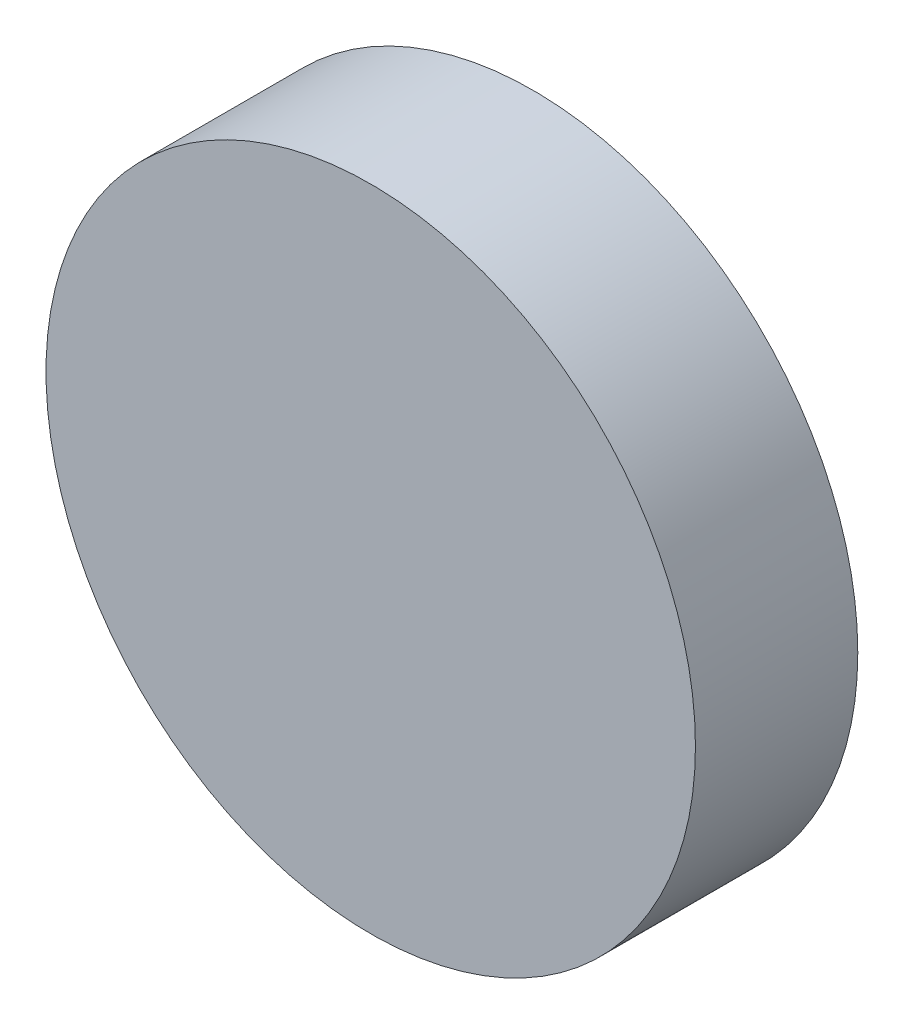
ISO-10303-21;
HEADER;
FILE_DESCRIPTION(('STEP AP214'),'2;1');
FILE_NAME('part.step','',(''),(''),'','','');
FILE_SCHEMA(('AUTOMOTIVE_DESIGN { 1 0 10303 214 1 1 1 1 }'));
ENDSEC;
DATA;
#1=APPLICATION_CONTEXT('core data for automotive mechanical design processes');
#2=APPLICATION_PROTOCOL_DEFINITION('international standard','automotive_design',2000,#1);
#3=PRODUCT_CONTEXT('',#1,'mechanical');
#4=PRODUCT('Part','Part','',(#3));
#5=PRODUCT_RELATED_PRODUCT_CATEGORY('part','',(#4));
#6=PRODUCT_DEFINITION_FORMATION('','',#4);
#7=PRODUCT_DEFINITION_CONTEXT('part definition',#1,'design');
#8=PRODUCT_DEFINITION('design','',#6,#7);
#9=PRODUCT_DEFINITION_SHAPE('','',#8);
#10=(LENGTH_UNIT() NAMED_UNIT(*) SI_UNIT(.MILLI.,.METRE.));
#11=(NAMED_UNIT(*) PLANE_ANGLE_UNIT() SI_UNIT($,.RADIAN.));
#12=(NAMED_UNIT(*) SI_UNIT($,.STERADIAN.) SOLID_ANGLE_UNIT());
#13=UNCERTAINTY_MEASURE_WITH_UNIT(LENGTH_MEASURE(1.E-05),#10,'distance_accuracy_value','');
#14=(GEOMETRIC_REPRESENTATION_CONTEXT(3) GLOBAL_UNCERTAINTY_ASSIGNED_CONTEXT((#13)) GLOBAL_UNIT_ASSIGNED_CONTEXT((#10,
#11,#12)) REPRESENTATION_CONTEXT('',''));
#15=CARTESIAN_POINT('',(0.,0.,0.));
#16=DIRECTION('',(0.,0.,1.));
#17=DIRECTION('',(1.,0.,0.));
#18=AXIS2_PLACEMENT_3D('',#15,#16,#17);
#19=CARTESIAN_POINT('',(0.,0.,31.75));
#20=DIRECTION('',(0.,0.,-1.));
#21=DIRECTION('',(-1.,0.,0.));
#22=AXIS2_PLACEMENT_3D('',#19,#20,#21);
#23=CYLINDRICAL_SURFACE('',#22,63.5);
#24=CARTESIAN_POINT('',(0.,0.,31.75));
#25=DIRECTION('',(0.,0.,1.));
#26=DIRECTION('',(1.,0.,0.));
#27=AXIS2_PLACEMENT_3D('',#24,#25,#26);
#28=CIRCLE('',#27,63.5);
#29=CARTESIAN_POINT('',(63.5,0.,31.75));
#30=VERTEX_POINT('',#29);
#31=EDGE_CURVE('E10',#30,#30,#28,.T.);
#32=ORIENTED_EDGE('',*,*,#31,.F.);
#33=EDGE_LOOP('',(#32));
#34=FACE_BOUND('',#33,.T.);
#35=CARTESIAN_POINT('',(0.,0.,0.));
#36=DIRECTION('',(0.,0.,1.));
#37=DIRECTION('',(1.,0.,0.));
#38=AXIS2_PLACEMENT_3D('',#35,#36,#37);
#39=CIRCLE('',#38,63.5);
#40=CARTESIAN_POINT('',(63.5,0.,0.));
#41=VERTEX_POINT('',#40);
#42=EDGE_CURVE('E34',#41,#41,#39,.T.);
#43=ORIENTED_EDGE('',*,*,#42,.T.);
#44=EDGE_LOOP('',(#43));
#45=FACE_BOUND('',#44,.T.);
#46=ADVANCED_FACE('F31',(#34,#45),#23,.T.);
#47=CARTESIAN_POINT('',(0.,0.,31.75));
#48=DIRECTION('',(0.,0.,1.));
#49=DIRECTION('',(1.,0.,0.));
#50=AXIS2_PLACEMENT_3D('',#47,#48,#49);
#51=PLANE('',#50);
#52=ORIENTED_EDGE('',*,*,#31,.T.);
#53=EDGE_LOOP('',(#52));
#54=FACE_BOUND('',#53,.T.);
#55=ADVANCED_FACE('F73',(#54),#51,.T.);
#56=CARTESIAN_POINT('',(0.,0.,0.));
#57=DIRECTION('',(0.,0.,1.));
#58=DIRECTION('',(1.,0.,0.));
#59=AXIS2_PLACEMENT_3D('',#56,#57,#58);
#60=PLANE('',#59);
#61=CARTESIAN_POINT('',(0.,0.,0.));
#62=DIRECTION('',(0.,0.,-1.));
#63=DIRECTION('',(-1.,0.,0.));
#64=AXIS2_PLACEMENT_3D('',#61,#62,#63);
#65=CIRCLE('',#64,57.15);
#66=CARTESIAN_POINT('',(-57.15,0.,0.));
#67=VERTEX_POINT('',#66);
#68=EDGE_CURVE('E43',#67,#67,#65,.T.);
#69=ORIENTED_EDGE('',*,*,#68,.F.);
#70=EDGE_LOOP('',(#69));
#71=FACE_BOUND('',#70,.T.);
#72=ORIENTED_EDGE('',*,*,#42,.F.);
#73=EDGE_LOOP('',(#72));
#74=FACE_BOUND('',#73,.T.);
#75=ADVANCED_FACE('F67',(#71,#74),#60,.F.);
#76=CARTESIAN_POINT('',(0.,0.,3.175));
#77=DIRECTION('',(0.,0.,-1.));
#78=DIRECTION('',(-1.,0.,0.));
#79=AXIS2_PLACEMENT_3D('',#76,#77,#78);
#80=CYLINDRICAL_SURFACE('',#79,57.15);
#81=CARTESIAN_POINT('',(0.,0.,3.175));
#82=DIRECTION('',(0.,0.,-1.));
#83=DIRECTION('',(-1.,0.,0.));
#84=AXIS2_PLACEMENT_3D('',#81,#82,#83);
#85=CIRCLE('',#84,57.15);
#86=CARTESIAN_POINT('',(-57.15,0.,3.175));
#87=VERTEX_POINT('',#86);
#88=EDGE_CURVE('E41',#87,#87,#85,.T.);
#89=ORIENTED_EDGE('',*,*,#88,.F.);
#90=EDGE_LOOP('',(#89));
#91=FACE_BOUND('',#90,.T.);
#92=ORIENTED_EDGE('',*,*,#68,.T.);
#93=EDGE_LOOP('',(#92));
#94=FACE_BOUND('',#93,.T.);
#95=ADVANCED_FACE('F61',(#91,#94),#80,.F.);
#96=CARTESIAN_POINT('',(0.,0.,3.175));
#97=DIRECTION('',(0.,0.,-1.));
#98=DIRECTION('',(-1.,0.,0.));
#99=AXIS2_PLACEMENT_3D('',#96,#97,#98);
#100=PLANE('',#99);
#101=CARTESIAN_POINT('',(0.,0.,3.175));
#102=DIRECTION('',(0.,0.,-1.));
#103=DIRECTION('',(-1.,0.,0.));
#104=AXIS2_PLACEMENT_3D('',#101,#102,#103);
#105=CIRCLE('',#104,55.5625);
#106=CARTESIAN_POINT('',(-55.5625,0.,3.175));
#107=VERTEX_POINT('',#106);
#108=EDGE_CURVE('E46',#107,#107,#105,.T.);
#109=ORIENTED_EDGE('',*,*,#108,.F.);
#110=EDGE_LOOP('',(#109));
#111=FACE_BOUND('',#110,.T.);
#112=ORIENTED_EDGE('',*,*,#88,.T.);
#113=EDGE_LOOP('',(#112));
#114=FACE_BOUND('',#113,.T.);
#115=ADVANCED_FACE('F58',(#111,#114),#100,.T.);
#116=CARTESIAN_POINT('',(0.,0.,3.175));
#117=DIRECTION('',(0.,0.,-1.));
#118=DIRECTION('',(-1.,0.,0.));
#119=AXIS2_PLACEMENT_3D('',#116,#117,#118);
#120=CYLINDRICAL_SURFACE('',#119,55.5625);
#121=ORIENTED_EDGE('',*,*,#108,.T.);
#122=EDGE_LOOP('',(#121));
#123=FACE_BOUND('',#122,.T.);
#124=CARTESIAN_POINT('',(0.,0.,0.));
#125=DIRECTION('',(0.,0.,-1.));
#126=DIRECTION('',(-1.,0.,0.));
#127=AXIS2_PLACEMENT_3D('',#124,#125,#126);
#128=CIRCLE('',#127,55.5625);
#129=CARTESIAN_POINT('',(-55.5625,0.,0.));
#130=VERTEX_POINT('',#129);
#131=EDGE_CURVE('E49',#130,#130,#128,.T.);
#132=ORIENTED_EDGE('',*,*,#131,.F.);
#133=EDGE_LOOP('',(#132));
#134=FACE_BOUND('',#133,.T.);
#135=ADVANCED_FACE('F55',(#123,#134),#120,.T.);
#136=ORIENTED_EDGE('',*,*,#131,.T.);
#137=EDGE_LOOP('',(#136));
#138=FACE_BOUND('',#137,.T.);
#139=ADVANCED_FACE('F74',(#138),#60,.F.);
#140=CLOSED_SHELL('',(#46,#55,#75,#95,#115,#135,#139));
#141=MANIFOLD_SOLID_BREP('B2',#140);
#142=ADVANCED_BREP_SHAPE_REPRESENTATION('',(#18,#141),#14);
#143=SHAPE_DEFINITION_REPRESENTATION(#9,#142);
ENDSEC;
END-ISO-10303-21;
